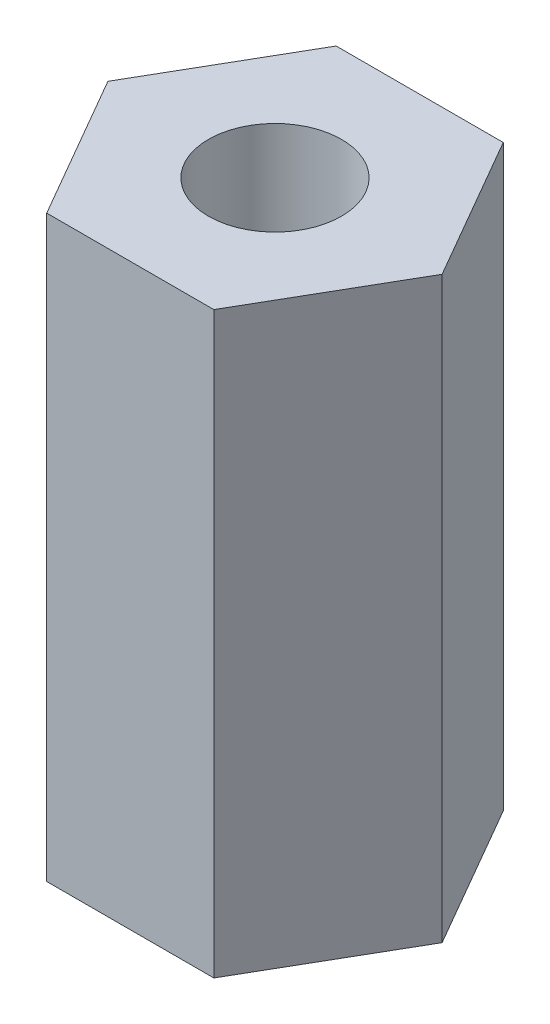
ISO-10303-21;
HEADER;
FILE_DESCRIPTION(('STEP AP214'),'2;1');
FILE_NAME('part.step','',(''),(''),'','','');
FILE_SCHEMA(('AUTOMOTIVE_DESIGN { 1 0 10303 214 1 1 1 1 }'));
ENDSEC;
DATA;
#1=APPLICATION_CONTEXT('core data for automotive mechanical design processes');
#2=APPLICATION_PROTOCOL_DEFINITION('international standard','automotive_design',2000,#1);
#3=PRODUCT_CONTEXT('',#1,'mechanical');
#4=PRODUCT('Part','Part','',(#3));
#5=PRODUCT_RELATED_PRODUCT_CATEGORY('part','',(#4));
#6=PRODUCT_DEFINITION_FORMATION('','',#4);
#7=PRODUCT_DEFINITION_CONTEXT('part definition',#1,'design');
#8=PRODUCT_DEFINITION('design','',#6,#7);
#9=PRODUCT_DEFINITION_SHAPE('','',#8);
#10=(LENGTH_UNIT() NAMED_UNIT(*) SI_UNIT(.MILLI.,.METRE.));
#11=(NAMED_UNIT(*) PLANE_ANGLE_UNIT() SI_UNIT($,.RADIAN.));
#12=(NAMED_UNIT(*) SI_UNIT($,.STERADIAN.) SOLID_ANGLE_UNIT());
#13=UNCERTAINTY_MEASURE_WITH_UNIT(LENGTH_MEASURE(1.E-05),#10,'distance_accuracy_value','');
#14=(GEOMETRIC_REPRESENTATION_CONTEXT(3) GLOBAL_UNCERTAINTY_ASSIGNED_CONTEXT((#13)) GLOBAL_UNIT_ASSIGNED_CONTEXT((#10,
#11,#12)) REPRESENTATION_CONTEXT('',''));
#15=CARTESIAN_POINT('',(0.,0.,0.));
#16=DIRECTION('',(0.,0.,1.));
#17=DIRECTION('',(1.,0.,0.));
#18=AXIS2_PLACEMENT_3D('',#15,#16,#17);
#19=CARTESIAN_POINT('',(0.,10.,0.));
#20=DIRECTION('',(0.,1.,0.));
#21=DIRECTION('',(0.,0.,1.));
#22=AXIS2_PLACEMENT_3D('',#19,#20,#21);
#23=PLANE('',#22);
#24=DIRECTION('',(0.499999999999995,0.,-0.866025403784441));
#25=VECTOR('',#24,1.);
#26=CARTESIAN_POINT('',(1.44337567297409,10.,2.49999999999997));
#27=LINE('',#26,#25);
#28=CARTESIAN_POINT('',(1.44337567297409,10.,2.49999999999997));
#29=VERTEX_POINT('',#28);
#30=CARTESIAN_POINT('',(2.88675134594812,10.,0.));
#31=VERTEX_POINT('',#30);
#32=EDGE_CURVE('E135',#29,#31,#27,.T.);
#33=ORIENTED_EDGE('',*,*,#32,.T.);
#34=DIRECTION('',(-0.500000000000001,0.,-0.866025403784438));
#35=VECTOR('',#34,1.);
#36=CARTESIAN_POINT('',(2.88675134594812,10.,0.));
#37=LINE('',#36,#35);
#38=CARTESIAN_POINT('',(1.44337567297405,10.,-2.49999999999999));
#39=VERTEX_POINT('',#38);
#40=EDGE_CURVE('E93',#31,#39,#37,.T.);
#41=ORIENTED_EDGE('',*,*,#40,.T.);
#42=DIRECTION('',(-1.,0.,0.));
#43=VECTOR('',#42,1.);
#44=CARTESIAN_POINT('',(1.44337567297405,10.,-2.49999999999999));
#45=LINE('',#44,#43);
#46=CARTESIAN_POINT('',(-1.44337567297407,10.,-2.49999999999998));
#47=VERTEX_POINT('',#46);
#48=EDGE_CURVE('E106',#39,#47,#45,.T.);
#49=ORIENTED_EDGE('',*,*,#48,.T.);
#50=DIRECTION('',(-0.499999999999995,0.,0.866025403784442));
#51=VECTOR('',#50,1.);
#52=CARTESIAN_POINT('',(-1.44337567297407,10.,-2.49999999999998));
#53=LINE('',#52,#51);
#54=CARTESIAN_POINT('',(-2.88675134594812,10.,0.));
#55=VERTEX_POINT('',#54);
#56=EDGE_CURVE('E100',#47,#55,#53,.T.);
#57=ORIENTED_EDGE('',*,*,#56,.T.);
#58=DIRECTION('',(0.500000000000007,0.,0.866025403784435));
#59=VECTOR('',#58,1.);
#60=CARTESIAN_POINT('',(-2.88675134594812,10.,0.));
#61=LINE('',#60,#59);
#62=CARTESIAN_POINT('',(-1.44337567297404,10.,2.5));
#63=VERTEX_POINT('',#62);
#64=EDGE_CURVE('E104',#55,#63,#61,.T.);
#65=ORIENTED_EDGE('',*,*,#64,.T.);
#66=DIRECTION('',(1.,0.,0.));
#67=VECTOR('',#66,1.);
#68=CARTESIAN_POINT('',(-1.44337567297404,10.,2.5));
#69=LINE('',#68,#67);
#70=EDGE_CURVE('E56',#63,#29,#69,.T.);
#71=ORIENTED_EDGE('',*,*,#70,.T.);
#72=EDGE_LOOP('',(#33,#41,#49,#57,#65,#71));
#73=FACE_BOUND('',#72,.T.);
#74=CARTESIAN_POINT('',(0.,10.,0.));
#75=DIRECTION('',(0.,1.,0.));
#76=DIRECTION('',(0.,0.,1.));
#77=AXIS2_PLACEMENT_3D('',#74,#75,#76);
#78=CIRCLE('',#77,1.15);
#79=CARTESIAN_POINT('',(0.,10.,1.15));
#80=VERTEX_POINT('',#79);
#81=EDGE_CURVE('E128',#80,#80,#78,.T.);
#82=ORIENTED_EDGE('',*,*,#81,.F.);
#83=EDGE_LOOP('',(#82));
#84=FACE_BOUND('',#83,.T.);
#85=ADVANCED_FACE('F39',(#73,#84),#23,.T.);
#86=CARTESIAN_POINT('',(0.,0.,0.));
#87=DIRECTION('',(0.,1.,0.));
#88=DIRECTION('',(0.,0.,1.));
#89=AXIS2_PLACEMENT_3D('',#86,#87,#88);
#90=PLANE('',#89);
#91=DIRECTION('',(0.499999999999995,0.,-0.866025403784441));
#92=VECTOR('',#91,1.);
#93=CARTESIAN_POINT('',(1.44337567297409,0.,2.49999999999997));
#94=LINE('',#93,#92);
#95=CARTESIAN_POINT('',(1.44337567297409,0.,2.49999999999997));
#96=VERTEX_POINT('',#95);
#97=CARTESIAN_POINT('',(2.88675134594812,0.,0.));
#98=VERTEX_POINT('',#97);
#99=EDGE_CURVE('E124',#96,#98,#94,.T.);
#100=ORIENTED_EDGE('',*,*,#99,.F.);
#101=DIRECTION('',(1.,0.,0.));
#102=VECTOR('',#101,1.);
#103=CARTESIAN_POINT('',(-1.44337567297404,0.,2.5));
#104=LINE('',#103,#102);
#105=CARTESIAN_POINT('',(-1.44337567297404,0.,2.5));
#106=VERTEX_POINT('',#105);
#107=EDGE_CURVE('E85',#106,#96,#104,.T.);
#108=ORIENTED_EDGE('',*,*,#107,.F.);
#109=DIRECTION('',(0.500000000000007,0.,0.866025403784435));
#110=VECTOR('',#109,1.);
#111=CARTESIAN_POINT('',(-2.88675134594812,0.,0.));
#112=LINE('',#111,#110);
#113=CARTESIAN_POINT('',(-2.88675134594812,0.,0.));
#114=VERTEX_POINT('',#113);
#115=EDGE_CURVE('E79',#114,#106,#112,.T.);
#116=ORIENTED_EDGE('',*,*,#115,.F.);
#117=DIRECTION('',(-0.499999999999995,0.,0.866025403784442));
#118=VECTOR('',#117,1.);
#119=CARTESIAN_POINT('',(-1.44337567297407,0.,-2.49999999999998));
#120=LINE('',#119,#118);
#121=CARTESIAN_POINT('',(-1.44337567297407,0.,-2.49999999999998));
#122=VERTEX_POINT('',#121);
#123=EDGE_CURVE('E114',#122,#114,#120,.T.);
#124=ORIENTED_EDGE('',*,*,#123,.F.);
#125=DIRECTION('',(-1.,0.,0.));
#126=VECTOR('',#125,1.);
#127=CARTESIAN_POINT('',(1.44337567297405,0.,-2.49999999999999));
#128=LINE('',#127,#126);
#129=CARTESIAN_POINT('',(1.44337567297405,0.,-2.49999999999999));
#130=VERTEX_POINT('',#129);
#131=EDGE_CURVE('E130',#130,#122,#128,.T.);
#132=ORIENTED_EDGE('',*,*,#131,.F.);
#133=DIRECTION('',(-0.500000000000001,0.,-0.866025403784438));
#134=VECTOR('',#133,1.);
#135=CARTESIAN_POINT('',(2.88675134594812,0.,0.));
#136=LINE('',#135,#134);
#137=EDGE_CURVE('E127',#98,#130,#136,.T.);
#138=ORIENTED_EDGE('',*,*,#137,.F.);
#139=EDGE_LOOP('',(#100,#108,#116,#124,#132,#138));
#140=FACE_BOUND('',#139,.T.);
#141=CARTESIAN_POINT('',(0.,0.,0.));
#142=DIRECTION('',(0.,1.,0.));
#143=DIRECTION('',(0.,0.,1.));
#144=AXIS2_PLACEMENT_3D('',#141,#142,#143);
#145=CIRCLE('',#144,1.15);
#146=CARTESIAN_POINT('',(0.,0.,1.15));
#147=VERTEX_POINT('',#146);
#148=EDGE_CURVE('E228',#147,#147,#145,.T.);
#149=ORIENTED_EDGE('',*,*,#148,.T.);
#150=EDGE_LOOP('',(#149));
#151=FACE_BOUND('',#150,.T.);
#152=ADVANCED_FACE('F144',(#140,#151),#90,.F.);
#153=CARTESIAN_POINT('',(1.44337567297409,10.,2.49999999999997));
#154=DIRECTION('',(-0.866025403784441,0.,-0.499999999999995));
#155=DIRECTION('',(-0.499999999999995,0.,0.866025403784441));
#156=AXIS2_PLACEMENT_3D('',#153,#154,#155);
#157=PLANE('',#156);
#158=ORIENTED_EDGE('',*,*,#99,.T.);
#159=DIRECTION('',(0.,-1.,0.));
#160=VECTOR('',#159,1.);
#161=CARTESIAN_POINT('',(2.88675134594812,10.,0.));
#162=LINE('',#161,#160);
#163=EDGE_CURVE('E11',#31,#98,#162,.T.);
#164=ORIENTED_EDGE('',*,*,#163,.F.);
#165=ORIENTED_EDGE('',*,*,#32,.F.);
#166=DIRECTION('',(0.,-1.,0.));
#167=VECTOR('',#166,1.);
#168=CARTESIAN_POINT('',(1.44337567297409,10.,2.49999999999997));
#169=LINE('',#168,#167);
#170=EDGE_CURVE('E120',#29,#96,#169,.T.);
#171=ORIENTED_EDGE('',*,*,#170,.T.);
#172=EDGE_LOOP('',(#158,#164,#165,#171));
#173=FACE_BOUND('',#172,.T.);
#174=ADVANCED_FACE('F41',(#173),#157,.F.);
#175=CARTESIAN_POINT('',(2.88675134594812,10.,0.));
#176=DIRECTION('',(-0.866025403784438,0.,0.500000000000001));
#177=DIRECTION('',(0.500000000000001,0.,0.866025403784438));
#178=AXIS2_PLACEMENT_3D('',#175,#176,#177);
#179=PLANE('',#178);
#180=ORIENTED_EDGE('',*,*,#137,.T.);
#181=DIRECTION('',(0.,-1.,0.));
#182=VECTOR('',#181,1.);
#183=CARTESIAN_POINT('',(1.44337567297405,10.,-2.49999999999999));
#184=LINE('',#183,#182);
#185=EDGE_CURVE('E48',#39,#130,#184,.T.);
#186=ORIENTED_EDGE('',*,*,#185,.F.);
#187=ORIENTED_EDGE('',*,*,#40,.F.);
#188=ORIENTED_EDGE('',*,*,#163,.T.);
#189=EDGE_LOOP('',(#180,#186,#187,#188));
#190=FACE_BOUND('',#189,.T.);
#191=ADVANCED_FACE('F169',(#190),#179,.F.);
#192=CARTESIAN_POINT('',(1.44337567297405,10.,-2.49999999999999));
#193=DIRECTION('',(0.,0.,1.));
#194=DIRECTION('',(1.,0.,0.));
#195=AXIS2_PLACEMENT_3D('',#192,#193,#194);
#196=PLANE('',#195);
#197=ORIENTED_EDGE('',*,*,#131,.T.);
#198=DIRECTION('',(0.,-1.,0.));
#199=VECTOR('',#198,1.);
#200=CARTESIAN_POINT('',(-1.44337567297407,10.,-2.49999999999998));
#201=LINE('',#200,#199);
#202=EDGE_CURVE('E115',#47,#122,#201,.T.);
#203=ORIENTED_EDGE('',*,*,#202,.F.);
#204=ORIENTED_EDGE('',*,*,#48,.F.);
#205=ORIENTED_EDGE('',*,*,#185,.T.);
#206=EDGE_LOOP('',(#197,#203,#204,#205));
#207=FACE_BOUND('',#206,.T.);
#208=ADVANCED_FACE('F141',(#207),#196,.F.);
#209=CARTESIAN_POINT('',(-1.44337567297407,10.,-2.49999999999998));
#210=DIRECTION('',(0.866025403784442,0.,0.499999999999995));
#211=DIRECTION('',(0.499999999999995,0.,-0.866025403784442));
#212=AXIS2_PLACEMENT_3D('',#209,#210,#211);
#213=PLANE('',#212);
#214=ORIENTED_EDGE('',*,*,#123,.T.);
#215=DIRECTION('',(0.,-1.,0.));
#216=VECTOR('',#215,1.);
#217=CARTESIAN_POINT('',(-2.88675134594812,10.,0.));
#218=LINE('',#217,#216);
#219=EDGE_CURVE('E111',#55,#114,#218,.T.);
#220=ORIENTED_EDGE('',*,*,#219,.F.);
#221=ORIENTED_EDGE('',*,*,#56,.F.);
#222=ORIENTED_EDGE('',*,*,#202,.T.);
#223=EDGE_LOOP('',(#214,#220,#221,#222));
#224=FACE_BOUND('',#223,.T.);
#225=ADVANCED_FACE('F112',(#224),#213,.F.);
#226=CARTESIAN_POINT('',(-2.88675134594812,10.,0.));
#227=DIRECTION('',(0.866025403784435,0.,-0.500000000000007));
#228=DIRECTION('',(-0.500000000000007,0.,-0.866025403784435));
#229=AXIS2_PLACEMENT_3D('',#226,#227,#228);
#230=PLANE('',#229);
#231=ORIENTED_EDGE('',*,*,#115,.T.);
#232=DIRECTION('',(0.,-1.,0.));
#233=VECTOR('',#232,1.);
#234=CARTESIAN_POINT('',(-1.44337567297404,10.,2.5));
#235=LINE('',#234,#233);
#236=EDGE_CURVE('E116',#63,#106,#235,.T.);
#237=ORIENTED_EDGE('',*,*,#236,.F.);
#238=ORIENTED_EDGE('',*,*,#64,.F.);
#239=ORIENTED_EDGE('',*,*,#219,.T.);
#240=EDGE_LOOP('',(#231,#237,#238,#239));
#241=FACE_BOUND('',#240,.T.);
#242=ADVANCED_FACE('F118',(#241),#230,.F.);
#243=CARTESIAN_POINT('',(-1.44337567297404,10.,2.5));
#244=DIRECTION('',(0.,0.,-1.));
#245=DIRECTION('',(-1.,0.,0.));
#246=AXIS2_PLACEMENT_3D('',#243,#244,#245);
#247=PLANE('',#246);
#248=ORIENTED_EDGE('',*,*,#107,.T.);
#249=ORIENTED_EDGE('',*,*,#170,.F.);
#250=ORIENTED_EDGE('',*,*,#70,.F.);
#251=ORIENTED_EDGE('',*,*,#236,.T.);
#252=EDGE_LOOP('',(#248,#249,#250,#251));
#253=FACE_BOUND('',#252,.T.);
#254=ADVANCED_FACE('F149',(#253),#247,.F.);
#255=CARTESIAN_POINT('',(0.,10.,0.));
#256=DIRECTION('',(0.,-1.,0.));
#257=DIRECTION('',(0.,0.,-1.));
#258=AXIS2_PLACEMENT_3D('',#255,#256,#257);
#259=CYLINDRICAL_SURFACE('',#258,1.15);
#260=ORIENTED_EDGE('',*,*,#81,.T.);
#261=EDGE_LOOP('',(#260));
#262=FACE_BOUND('',#261,.T.);
#263=ORIENTED_EDGE('',*,*,#148,.F.);
#264=EDGE_LOOP('',(#263));
#265=FACE_BOUND('',#264,.T.);
#266=ADVANCED_FACE('F151',(#262,#265),#259,.F.);
#267=CLOSED_SHELL('',(#85,#152,#174,#191,#208,#225,#242,#254,#266));
#268=MANIFOLD_SOLID_BREP('B2',#267);
#269=ADVANCED_BREP_SHAPE_REPRESENTATION('',(#18,#268),#14);
#270=SHAPE_DEFINITION_REPRESENTATION(#9,#269);
ENDSEC;
END-ISO-10303-21;
